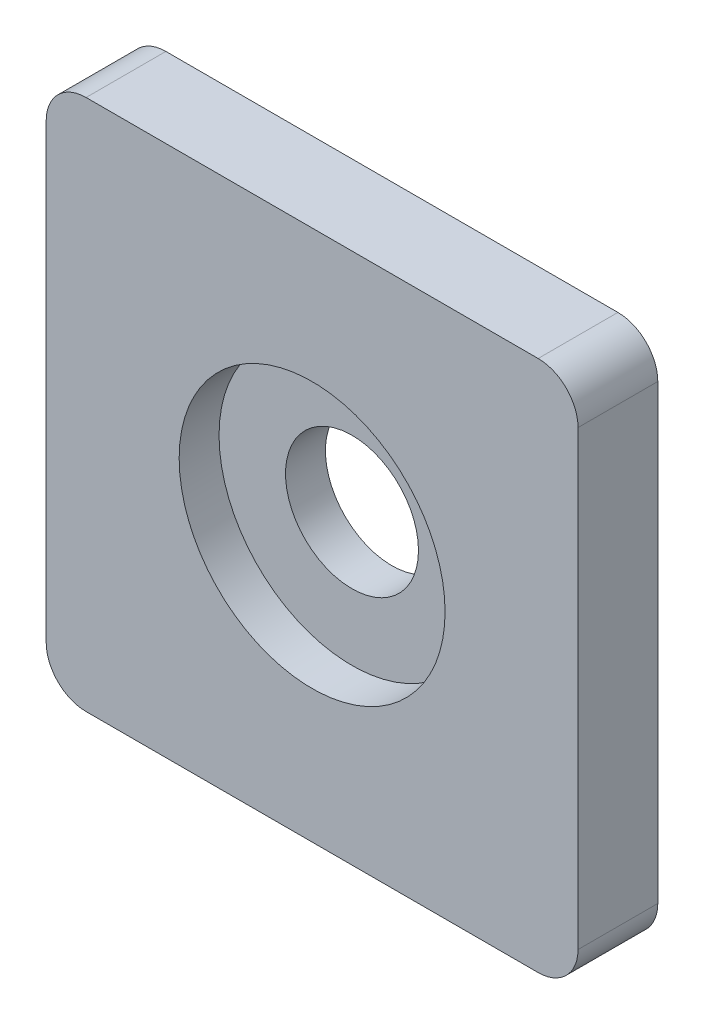
ISO-10303-21;
HEADER;
FILE_DESCRIPTION(('STEP AP214'),'2;1');
FILE_NAME('part.step','',(''),(''),'','','');
FILE_SCHEMA(('AUTOMOTIVE_DESIGN { 1 0 10303 214 1 1 1 1 }'));
ENDSEC;
DATA;
#1=APPLICATION_CONTEXT('core data for automotive mechanical design processes');
#2=APPLICATION_PROTOCOL_DEFINITION('international standard','automotive_design',2000,#1);
#3=PRODUCT_CONTEXT('',#1,'mechanical');
#4=PRODUCT('Part','Part','',(#3));
#5=PRODUCT_RELATED_PRODUCT_CATEGORY('part','',(#4));
#6=PRODUCT_DEFINITION_FORMATION('','',#4);
#7=PRODUCT_DEFINITION_CONTEXT('part definition',#1,'design');
#8=PRODUCT_DEFINITION('design','',#6,#7);
#9=PRODUCT_DEFINITION_SHAPE('','',#8);
#10=(LENGTH_UNIT() NAMED_UNIT(*) SI_UNIT(.MILLI.,.METRE.));
#11=(NAMED_UNIT(*) PLANE_ANGLE_UNIT() SI_UNIT($,.RADIAN.));
#12=(NAMED_UNIT(*) SI_UNIT($,.STERADIAN.) SOLID_ANGLE_UNIT());
#13=UNCERTAINTY_MEASURE_WITH_UNIT(LENGTH_MEASURE(1.E-05),#10,'distance_accuracy_value','');
#14=(GEOMETRIC_REPRESENTATION_CONTEXT(3) GLOBAL_UNCERTAINTY_ASSIGNED_CONTEXT((#13)) GLOBAL_UNIT_ASSIGNED_CONTEXT((#10,
#11,#12)) REPRESENTATION_CONTEXT('',''));
#15=CARTESIAN_POINT('',(0.,0.,0.));
#16=DIRECTION('',(0.,0.,1.));
#17=DIRECTION('',(1.,0.,0.));
#18=AXIS2_PLACEMENT_3D('',#15,#16,#17);
#19=CARTESIAN_POINT('',(0.,0.,3.));
#20=DIRECTION('',(0.,0.,-1.));
#21=DIRECTION('',(-1.,0.,0.));
#22=AXIS2_PLACEMENT_3D('',#19,#20,#21);
#23=CYLINDRICAL_SURFACE('',#22,2.5);
#24=CARTESIAN_POINT('',(0.,0.,0.));
#25=DIRECTION('',(0.,0.,1.));
#26=DIRECTION('',(1.,0.,0.));
#27=AXIS2_PLACEMENT_3D('',#24,#25,#26);
#28=CIRCLE('',#27,2.5);
#29=CARTESIAN_POINT('',(2.5,0.,0.));
#30=VERTEX_POINT('',#29);
#31=EDGE_CURVE('E139',#30,#30,#28,.T.);
#32=ORIENTED_EDGE('',*,*,#31,.F.);
#33=EDGE_LOOP('',(#32));
#34=FACE_BOUND('',#33,.T.);
#35=CARTESIAN_POINT('',(0.,0.,1.5));
#36=DIRECTION('',(0.,0.,1.));
#37=DIRECTION('',(1.,0.,0.));
#38=AXIS2_PLACEMENT_3D('',#35,#36,#37);
#39=CIRCLE('',#38,2.5);
#40=CARTESIAN_POINT('',(2.5,0.,1.5));
#41=VERTEX_POINT('',#40);
#42=EDGE_CURVE('E136',#41,#41,#39,.T.);
#43=ORIENTED_EDGE('',*,*,#42,.T.);
#44=EDGE_LOOP('',(#43));
#45=FACE_BOUND('',#44,.T.);
#46=ADVANCED_FACE('F34',(#34,#45),#23,.F.);
#47=CARTESIAN_POINT('',(0.,0.,3.));
#48=DIRECTION('',(0.,0.,1.));
#49=DIRECTION('',(1.,0.,0.));
#50=AXIS2_PLACEMENT_3D('',#47,#48,#49);
#51=PLANE('',#50);
#52=CARTESIAN_POINT('',(0.,0.,3.));
#53=DIRECTION('',(0.,0.,1.));
#54=DIRECTION('',(1.,0.,0.));
#55=AXIS2_PLACEMENT_3D('',#52,#53,#54);
#56=CIRCLE('',#55,5.);
#57=CARTESIAN_POINT('',(5.,0.,3.));
#58=VERTEX_POINT('',#57);
#59=EDGE_CURVE('E179',#58,#58,#56,.T.);
#60=ORIENTED_EDGE('',*,*,#59,.F.);
#61=EDGE_LOOP('',(#60));
#62=FACE_BOUND('',#61,.T.);
#63=DIRECTION('',(0.,1.,0.));
#64=VECTOR('',#63,1.);
#65=CARTESIAN_POINT('',(10.,-10.,3.));
#66=LINE('',#65,#64);
#67=CARTESIAN_POINT('',(10.,-8.5,3.));
#68=VERTEX_POINT('',#67);
#69=CARTESIAN_POINT('',(10.,8.5,3.));
#70=VERTEX_POINT('',#69);
#71=EDGE_CURVE('E175',#68,#70,#66,.T.);
#72=ORIENTED_EDGE('',*,*,#71,.T.);
#73=CARTESIAN_POINT('',(8.5,8.5,3.));
#74=DIRECTION('',(0.,0.,1.));
#75=DIRECTION('',(1.,0.,0.));
#76=AXIS2_PLACEMENT_3D('',#73,#74,#75);
#77=CIRCLE('',#76,1.5);
#78=CARTESIAN_POINT('',(8.5,10.,3.));
#79=VERTEX_POINT('',#78);
#80=EDGE_CURVE('E154',#70,#79,#77,.T.);
#81=ORIENTED_EDGE('',*,*,#80,.T.);
#82=DIRECTION('',(-1.,0.,0.));
#83=VECTOR('',#82,1.);
#84=CARTESIAN_POINT('',(10.,10.,3.));
#85=LINE('',#84,#83);
#86=CARTESIAN_POINT('',(-8.5,9.99999999999999,3.));
#87=VERTEX_POINT('',#86);
#88=EDGE_CURVE('E120',#79,#87,#85,.T.);
#89=ORIENTED_EDGE('',*,*,#88,.T.);
#90=CARTESIAN_POINT('',(-8.5,8.49999999999999,3.));
#91=DIRECTION('',(0.,0.,1.));
#92=DIRECTION('',(1.,0.,0.));
#93=AXIS2_PLACEMENT_3D('',#90,#91,#92);
#94=CIRCLE('',#93,1.5);
#95=CARTESIAN_POINT('',(-10.,8.49999999999999,3.));
#96=VERTEX_POINT('',#95);
#97=EDGE_CURVE('E149',#87,#96,#94,.T.);
#98=ORIENTED_EDGE('',*,*,#97,.T.);
#99=DIRECTION('',(0.,-1.,0.));
#100=VECTOR('',#99,1.);
#101=CARTESIAN_POINT('',(-10.,-10.,3.));
#102=LINE('',#101,#100);
#103=CARTESIAN_POINT('',(-10.,-8.5,3.));
#104=VERTEX_POINT('',#103);
#105=EDGE_CURVE('E127',#96,#104,#102,.T.);
#106=ORIENTED_EDGE('',*,*,#105,.T.);
#107=CARTESIAN_POINT('',(-8.5,-8.5,3.));
#108=DIRECTION('',(0.,0.,1.));
#109=DIRECTION('',(1.,0.,0.));
#110=AXIS2_PLACEMENT_3D('',#107,#108,#109);
#111=CIRCLE('',#110,1.5);
#112=CARTESIAN_POINT('',(-8.5,-10.,3.));
#113=VERTEX_POINT('',#112);
#114=EDGE_CURVE('E56',#104,#113,#111,.T.);
#115=ORIENTED_EDGE('',*,*,#114,.T.);
#116=DIRECTION('',(1.,0.,0.));
#117=VECTOR('',#116,1.);
#118=CARTESIAN_POINT('',(10.,-10.,3.));
#119=LINE('',#118,#117);
#120=CARTESIAN_POINT('',(8.5,-10.,3.));
#121=VERTEX_POINT('',#120);
#122=EDGE_CURVE('E130',#113,#121,#119,.T.);
#123=ORIENTED_EDGE('',*,*,#122,.T.);
#124=CARTESIAN_POINT('',(8.5,-8.5,3.));
#125=DIRECTION('',(0.,0.,1.));
#126=DIRECTION('',(1.,0.,0.));
#127=AXIS2_PLACEMENT_3D('',#124,#125,#126);
#128=CIRCLE('',#127,1.5);
#129=EDGE_CURVE('E152',#121,#68,#128,.T.);
#130=ORIENTED_EDGE('',*,*,#129,.T.);
#131=EDGE_LOOP('',(#72,#81,#89,#98,#106,#115,#123,#130));
#132=FACE_BOUND('',#131,.T.);
#133=ADVANCED_FACE('F193',(#62,#132),#51,.T.);
#134=CARTESIAN_POINT('',(0.,0.,0.));
#135=DIRECTION('',(0.,0.,1.));
#136=DIRECTION('',(1.,0.,0.));
#137=AXIS2_PLACEMENT_3D('',#134,#135,#136);
#138=PLANE('',#137);
#139=DIRECTION('',(-1.,0.,0.));
#140=VECTOR('',#139,1.);
#141=CARTESIAN_POINT('',(10.,10.,0.));
#142=LINE('',#141,#140);
#143=CARTESIAN_POINT('',(8.5,10.,0.));
#144=VERTEX_POINT('',#143);
#145=CARTESIAN_POINT('',(-8.5,9.99999999999999,0.));
#146=VERTEX_POINT('',#145);
#147=EDGE_CURVE('E117',#144,#146,#142,.T.);
#148=ORIENTED_EDGE('',*,*,#147,.F.);
#149=CARTESIAN_POINT('',(8.5,8.5,0.));
#150=DIRECTION('',(0.,0.,1.));
#151=DIRECTION('',(1.,0.,0.));
#152=AXIS2_PLACEMENT_3D('',#149,#150,#151);
#153=CIRCLE('',#152,1.5);
#154=CARTESIAN_POINT('',(10.,8.5,0.));
#155=VERTEX_POINT('',#154);
#156=EDGE_CURVE('E100',#144,#155,#153,.F.);
#157=ORIENTED_EDGE('',*,*,#156,.T.);
#158=DIRECTION('',(0.,1.,0.));
#159=VECTOR('',#158,1.);
#160=CARTESIAN_POINT('',(10.,-10.,0.));
#161=LINE('',#160,#159);
#162=CARTESIAN_POINT('',(10.,-8.5,0.));
#163=VERTEX_POINT('',#162);
#164=EDGE_CURVE('E128',#163,#155,#161,.T.);
#165=ORIENTED_EDGE('',*,*,#164,.F.);
#166=CARTESIAN_POINT('',(8.5,-8.5,0.));
#167=DIRECTION('',(0.,0.,1.));
#168=DIRECTION('',(1.,0.,0.));
#169=AXIS2_PLACEMENT_3D('',#166,#167,#168);
#170=CIRCLE('',#169,1.5);
#171=CARTESIAN_POINT('',(8.5,-10.,0.));
#172=VERTEX_POINT('',#171);
#173=EDGE_CURVE('E111',#163,#172,#170,.F.);
#174=ORIENTED_EDGE('',*,*,#173,.T.);
#175=DIRECTION('',(1.,0.,0.));
#176=VECTOR('',#175,1.);
#177=CARTESIAN_POINT('',(10.,-10.,0.));
#178=LINE('',#177,#176);
#179=CARTESIAN_POINT('',(-8.5,-10.,0.));
#180=VERTEX_POINT('',#179);
#181=EDGE_CURVE('E132',#180,#172,#178,.T.);
#182=ORIENTED_EDGE('',*,*,#181,.F.);
#183=CARTESIAN_POINT('',(-8.5,-8.5,0.));
#184=DIRECTION('',(0.,0.,1.));
#185=DIRECTION('',(1.,0.,0.));
#186=AXIS2_PLACEMENT_3D('',#183,#184,#185);
#187=CIRCLE('',#186,1.5);
#188=CARTESIAN_POINT('',(-10.,-8.5,0.));
#189=VERTEX_POINT('',#188);
#190=EDGE_CURVE('E143',#180,#189,#187,.F.);
#191=ORIENTED_EDGE('',*,*,#190,.T.);
#192=DIRECTION('',(0.,-1.,0.));
#193=VECTOR('',#192,1.);
#194=CARTESIAN_POINT('',(-10.,-10.,0.));
#195=LINE('',#194,#193);
#196=CARTESIAN_POINT('',(-10.,8.49999999999999,0.));
#197=VERTEX_POINT('',#196);
#198=EDGE_CURVE('E165',#197,#189,#195,.T.);
#199=ORIENTED_EDGE('',*,*,#198,.F.);
#200=CARTESIAN_POINT('',(-8.5,8.49999999999999,0.));
#201=DIRECTION('',(0.,0.,1.));
#202=DIRECTION('',(1.,0.,0.));
#203=AXIS2_PLACEMENT_3D('',#200,#201,#202);
#204=CIRCLE('',#203,1.5);
#205=EDGE_CURVE('E121',#197,#146,#204,.F.);
#206=ORIENTED_EDGE('',*,*,#205,.T.);
#207=EDGE_LOOP('',(#148,#157,#165,#174,#182,#191,#199,#206));
#208=FACE_BOUND('',#207,.T.);
#209=ORIENTED_EDGE('',*,*,#31,.T.);
#210=EDGE_LOOP('',(#209));
#211=FACE_BOUND('',#210,.T.);
#212=ADVANCED_FACE('F124',(#208,#211),#138,.F.);
#213=CARTESIAN_POINT('',(-10.,-10.,3.));
#214=DIRECTION('',(1.,0.,0.));
#215=DIRECTION('',(0.,0.,-1.));
#216=AXIS2_PLACEMENT_3D('',#213,#214,#215);
#217=PLANE('',#216);
#218=ORIENTED_EDGE('',*,*,#198,.T.);
#219=DIRECTION('',(0.,0.,-1.));
#220=VECTOR('',#219,1.);
#221=CARTESIAN_POINT('',(-10.,-8.5,3.));
#222=LINE('',#221,#220);
#223=EDGE_CURVE('E11',#189,#104,#222,.F.);
#224=ORIENTED_EDGE('',*,*,#223,.T.);
#225=ORIENTED_EDGE('',*,*,#105,.F.);
#226=DIRECTION('',(0.,0.,-1.));
#227=VECTOR('',#226,1.);
#228=CARTESIAN_POINT('',(-10.,8.49999999999999,3.));
#229=LINE('',#228,#227);
#230=EDGE_CURVE('E42',#96,#197,#229,.T.);
#231=ORIENTED_EDGE('',*,*,#230,.T.);
#232=EDGE_LOOP('',(#218,#224,#225,#231));
#233=FACE_BOUND('',#232,.T.);
#234=ADVANCED_FACE('F164',(#233),#217,.F.);
#235=CARTESIAN_POINT('',(10.,-10.,3.));
#236=DIRECTION('',(0.,1.,0.));
#237=DIRECTION('',(-1.,0.,0.));
#238=AXIS2_PLACEMENT_3D('',#235,#236,#237);
#239=PLANE('',#238);
#240=ORIENTED_EDGE('',*,*,#181,.T.);
#241=DIRECTION('',(0.,0.,-1.));
#242=VECTOR('',#241,1.);
#243=CARTESIAN_POINT('',(8.5,-10.,3.));
#244=LINE('',#243,#242);
#245=EDGE_CURVE('E49',#172,#121,#244,.F.);
#246=ORIENTED_EDGE('',*,*,#245,.T.);
#247=ORIENTED_EDGE('',*,*,#122,.F.);
#248=DIRECTION('',(0.,0.,-1.));
#249=VECTOR('',#248,1.);
#250=CARTESIAN_POINT('',(-8.5,-10.,3.));
#251=LINE('',#250,#249);
#252=EDGE_CURVE('E156',#113,#180,#251,.T.);
#253=ORIENTED_EDGE('',*,*,#252,.T.);
#254=EDGE_LOOP('',(#240,#246,#247,#253));
#255=FACE_BOUND('',#254,.T.);
#256=ADVANCED_FACE('F203',(#255),#239,.F.);
#257=CARTESIAN_POINT('',(10.,-10.,3.));
#258=DIRECTION('',(-1.,0.,0.));
#259=DIRECTION('',(0.,0.,1.));
#260=AXIS2_PLACEMENT_3D('',#257,#258,#259);
#261=PLANE('',#260);
#262=ORIENTED_EDGE('',*,*,#164,.T.);
#263=DIRECTION('',(0.,0.,-1.));
#264=VECTOR('',#263,1.);
#265=CARTESIAN_POINT('',(10.,8.5,3.));
#266=LINE('',#265,#264);
#267=EDGE_CURVE('E105',#155,#70,#266,.F.);
#268=ORIENTED_EDGE('',*,*,#267,.T.);
#269=ORIENTED_EDGE('',*,*,#71,.F.);
#270=DIRECTION('',(0.,0.,-1.));
#271=VECTOR('',#270,1.);
#272=CARTESIAN_POINT('',(10.,-8.5,3.));
#273=LINE('',#272,#271);
#274=EDGE_CURVE('E110',#68,#163,#273,.T.);
#275=ORIENTED_EDGE('',*,*,#274,.T.);
#276=EDGE_LOOP('',(#262,#268,#269,#275));
#277=FACE_BOUND('',#276,.T.);
#278=ADVANCED_FACE('F200',(#277),#261,.F.);
#279=CARTESIAN_POINT('',(10.,10.,3.));
#280=DIRECTION('',(0.,-1.,0.));
#281=DIRECTION('',(1.,0.,0.));
#282=AXIS2_PLACEMENT_3D('',#279,#280,#281);
#283=PLANE('',#282);
#284=ORIENTED_EDGE('',*,*,#88,.F.);
#285=DIRECTION('',(0.,0.,-1.));
#286=VECTOR('',#285,1.);
#287=CARTESIAN_POINT('',(8.5,10.,3.));
#288=LINE('',#287,#286);
#289=EDGE_CURVE('E104',#79,#144,#288,.T.);
#290=ORIENTED_EDGE('',*,*,#289,.T.);
#291=ORIENTED_EDGE('',*,*,#147,.T.);
#292=DIRECTION('',(0.,0.,-1.));
#293=VECTOR('',#292,1.);
#294=CARTESIAN_POINT('',(-8.5,9.99999999999999,3.));
#295=LINE('',#294,#293);
#296=EDGE_CURVE('E122',#146,#87,#295,.F.);
#297=ORIENTED_EDGE('',*,*,#296,.T.);
#298=EDGE_LOOP('',(#284,#290,#291,#297));
#299=FACE_BOUND('',#298,.T.);
#300=ADVANCED_FACE('F116',(#299),#283,.F.);
#301=CARTESIAN_POINT('',(0.,0.,1.5));
#302=DIRECTION('',(0.,0.,1.));
#303=DIRECTION('',(1.,0.,0.));
#304=AXIS2_PLACEMENT_3D('',#301,#302,#303);
#305=CYLINDRICAL_SURFACE('',#304,5.);
#306=CARTESIAN_POINT('',(0.,0.,1.5));
#307=DIRECTION('',(0.,0.,1.));
#308=DIRECTION('',(1.,0.,0.));
#309=AXIS2_PLACEMENT_3D('',#306,#307,#308);
#310=CIRCLE('',#309,5.);
#311=CARTESIAN_POINT('',(5.,0.,1.5));
#312=VERTEX_POINT('',#311);
#313=EDGE_CURVE('E140',#312,#312,#310,.T.);
#314=ORIENTED_EDGE('',*,*,#313,.F.);
#315=EDGE_LOOP('',(#314));
#316=FACE_BOUND('',#315,.T.);
#317=ORIENTED_EDGE('',*,*,#59,.T.);
#318=EDGE_LOOP('',(#317));
#319=FACE_BOUND('',#318,.T.);
#320=ADVANCED_FACE('F187',(#316,#319),#305,.F.);
#321=CARTESIAN_POINT('',(0.,0.,1.5));
#322=DIRECTION('',(0.,0.,1.));
#323=DIRECTION('',(1.,0.,0.));
#324=AXIS2_PLACEMENT_3D('',#321,#322,#323);
#325=PLANE('',#324);
#326=ORIENTED_EDGE('',*,*,#42,.F.);
#327=EDGE_LOOP('',(#326));
#328=FACE_BOUND('',#327,.T.);
#329=ORIENTED_EDGE('',*,*,#313,.T.);
#330=EDGE_LOOP('',(#329));
#331=FACE_BOUND('',#330,.T.);
#332=ADVANCED_FACE('F185',(#328,#331),#325,.T.);
#333=CARTESIAN_POINT('',(8.5,8.5,3.));
#334=DIRECTION('',(0.,0.,-1.));
#335=DIRECTION('',(-1.,0.,0.));
#336=AXIS2_PLACEMENT_3D('',#333,#334,#335);
#337=CYLINDRICAL_SURFACE('',#336,1.5);
#338=ORIENTED_EDGE('',*,*,#80,.F.);
#339=ORIENTED_EDGE('',*,*,#267,.F.);
#340=ORIENTED_EDGE('',*,*,#156,.F.);
#341=ORIENTED_EDGE('',*,*,#289,.F.);
#342=EDGE_LOOP('',(#338,#339,#340,#341));
#343=FACE_BOUND('',#342,.T.);
#344=ADVANCED_FACE('F103',(#343),#337,.T.);
#345=CARTESIAN_POINT('',(8.5,-8.5,3.));
#346=DIRECTION('',(0.,0.,-1.));
#347=DIRECTION('',(-1.,0.,0.));
#348=AXIS2_PLACEMENT_3D('',#345,#346,#347);
#349=CYLINDRICAL_SURFACE('',#348,1.5);
#350=ORIENTED_EDGE('',*,*,#129,.F.);
#351=ORIENTED_EDGE('',*,*,#245,.F.);
#352=ORIENTED_EDGE('',*,*,#173,.F.);
#353=ORIENTED_EDGE('',*,*,#274,.F.);
#354=EDGE_LOOP('',(#350,#351,#352,#353));
#355=FACE_BOUND('',#354,.T.);
#356=ADVANCED_FACE('F202',(#355),#349,.T.);
#357=CARTESIAN_POINT('',(-8.5,-8.5,3.));
#358=DIRECTION('',(0.,0.,-1.));
#359=DIRECTION('',(-1.,0.,0.));
#360=AXIS2_PLACEMENT_3D('',#357,#358,#359);
#361=CYLINDRICAL_SURFACE('',#360,1.5);
#362=ORIENTED_EDGE('',*,*,#114,.F.);
#363=ORIENTED_EDGE('',*,*,#223,.F.);
#364=ORIENTED_EDGE('',*,*,#190,.F.);
#365=ORIENTED_EDGE('',*,*,#252,.F.);
#366=EDGE_LOOP('',(#362,#363,#364,#365));
#367=FACE_BOUND('',#366,.T.);
#368=ADVANCED_FACE('F206',(#367),#361,.T.);
#369=CARTESIAN_POINT('',(-8.5,8.49999999999999,3.));
#370=DIRECTION('',(0.,0.,-1.));
#371=DIRECTION('',(-1.,0.,0.));
#372=AXIS2_PLACEMENT_3D('',#369,#370,#371);
#373=CYLINDRICAL_SURFACE('',#372,1.5);
#374=ORIENTED_EDGE('',*,*,#97,.F.);
#375=ORIENTED_EDGE('',*,*,#296,.F.);
#376=ORIENTED_EDGE('',*,*,#205,.F.);
#377=ORIENTED_EDGE('',*,*,#230,.F.);
#378=EDGE_LOOP('',(#374,#375,#376,#377));
#379=FACE_BOUND('',#378,.T.);
#380=ADVANCED_FACE('F36',(#379),#373,.T.);
#381=CLOSED_SHELL('',(#46,#133,#212,#234,#256,#278,#300,#320,#332,#344,#356,#368,#380));
#382=MANIFOLD_SOLID_BREP('B2',#381);
#383=ADVANCED_BREP_SHAPE_REPRESENTATION('',(#18,#382),#14);
#384=SHAPE_DEFINITION_REPRESENTATION(#9,#383);
ENDSEC;
END-ISO-10303-21;
